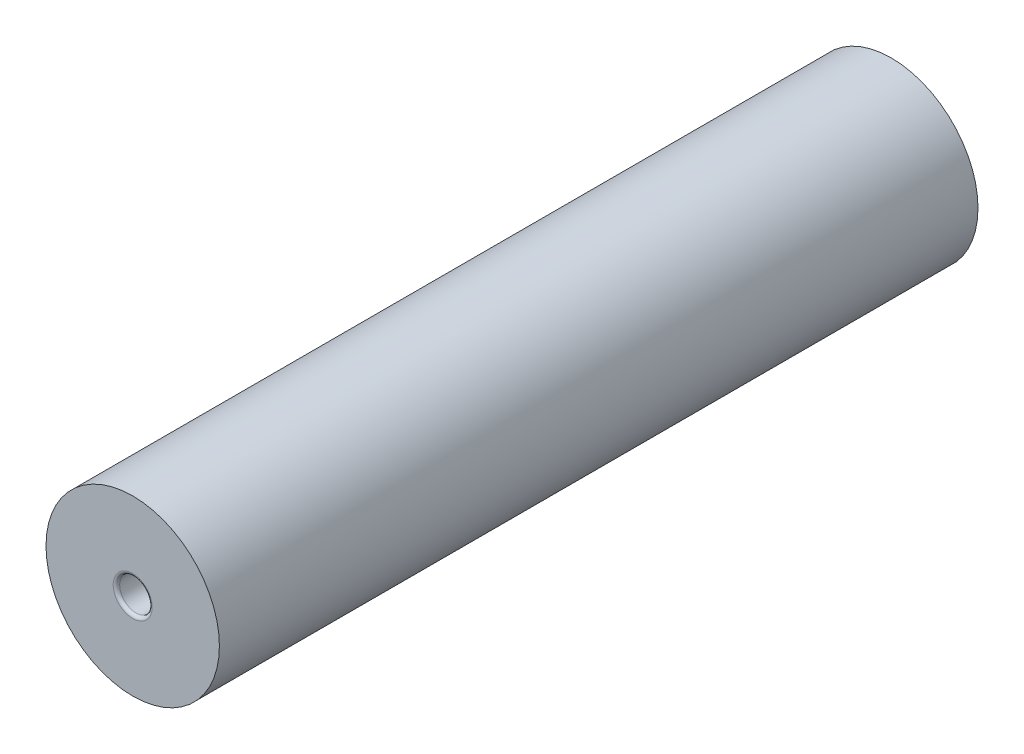
ISO-10303-21;
HEADER;
FILE_DESCRIPTION(('STEP AP214'),'2;1');
FILE_NAME('part.step','',(''),(''),'','','');
FILE_SCHEMA(('AUTOMOTIVE_DESIGN { 1 0 10303 214 1 1 1 1 }'));
ENDSEC;
DATA;
#1=APPLICATION_CONTEXT('core data for automotive mechanical design processes');
#2=APPLICATION_PROTOCOL_DEFINITION('international standard','automotive_design',2000,#1);
#3=PRODUCT_CONTEXT('',#1,'mechanical');
#4=PRODUCT('Part','Part','',(#3));
#5=PRODUCT_RELATED_PRODUCT_CATEGORY('part','',(#4));
#6=PRODUCT_DEFINITION_FORMATION('','',#4);
#7=PRODUCT_DEFINITION_CONTEXT('part definition',#1,'design');
#8=PRODUCT_DEFINITION('design','',#6,#7);
#9=PRODUCT_DEFINITION_SHAPE('','',#8);
#10=(LENGTH_UNIT() NAMED_UNIT(*) SI_UNIT(.MILLI.,.METRE.));
#11=(NAMED_UNIT(*) PLANE_ANGLE_UNIT() SI_UNIT($,.RADIAN.));
#12=(NAMED_UNIT(*) SI_UNIT($,.STERADIAN.) SOLID_ANGLE_UNIT());
#13=UNCERTAINTY_MEASURE_WITH_UNIT(LENGTH_MEASURE(1.E-05),#10,'distance_accuracy_value','');
#14=(GEOMETRIC_REPRESENTATION_CONTEXT(3) GLOBAL_UNCERTAINTY_ASSIGNED_CONTEXT((#13)) GLOBAL_UNIT_ASSIGNED_CONTEXT((#10,
#11,#12)) REPRESENTATION_CONTEXT('',''));
#15=CARTESIAN_POINT('',(0.,0.,0.));
#16=DIRECTION('',(0.,0.,1.));
#17=DIRECTION('',(1.,0.,0.));
#18=AXIS2_PLACEMENT_3D('',#15,#16,#17);
#19=CARTESIAN_POINT('',(0.,0.,-70.));
#20=DIRECTION('',(0.,0.,1.));
#21=DIRECTION('',(1.,0.,0.));
#22=AXIS2_PLACEMENT_3D('',#19,#20,#21);
#23=CYLINDRICAL_SURFACE('',#22,8.);
#24=CARTESIAN_POINT('',(0.,0.,-70.));
#25=DIRECTION('',(0.,0.,1.));
#26=DIRECTION('',(1.,0.,0.));
#27=AXIS2_PLACEMENT_3D('',#24,#25,#26);
#28=CIRCLE('',#27,8.);
#29=CARTESIAN_POINT('',(8.,0.,-70.));
#30=VERTEX_POINT('',#29);
#31=EDGE_CURVE('E57',#30,#30,#28,.T.);
#32=ORIENTED_EDGE('',*,*,#31,.T.);
#33=EDGE_LOOP('',(#32));
#34=FACE_BOUND('',#33,.T.);
#35=CARTESIAN_POINT('',(0.,0.,0.));
#36=DIRECTION('',(0.,0.,1.));
#37=DIRECTION('',(1.,0.,0.));
#38=AXIS2_PLACEMENT_3D('',#35,#36,#37);
#39=CIRCLE('',#38,8.);
#40=CARTESIAN_POINT('',(8.,0.,0.));
#41=VERTEX_POINT('',#40);
#42=EDGE_CURVE('E58',#41,#41,#39,.T.);
#43=ORIENTED_EDGE('',*,*,#42,.F.);
#44=EDGE_LOOP('',(#43));
#45=FACE_BOUND('',#44,.T.);
#46=ADVANCED_FACE('F37',(#34,#45),#23,.T.);
#47=CARTESIAN_POINT('',(0.,0.,-70.));
#48=DIRECTION('',(0.,0.,1.));
#49=DIRECTION('',(1.,0.,0.));
#50=AXIS2_PLACEMENT_3D('',#47,#48,#49);
#51=PLANE('',#50);
#52=CARTESIAN_POINT('',(0.,0.,-70.));
#53=DIRECTION('',(0.,0.,1.));
#54=DIRECTION('',(1.,0.,0.));
#55=AXIS2_PLACEMENT_3D('',#52,#53,#54);
#56=CIRCLE('',#55,1.8);
#57=CARTESIAN_POINT('',(1.8,0.,-70.));
#58=VERTEX_POINT('',#57);
#59=EDGE_CURVE('E52',#58,#58,#56,.T.);
#60=ORIENTED_EDGE('',*,*,#59,.T.);
#61=EDGE_LOOP('',(#60));
#62=FACE_BOUND('',#61,.T.);
#63=ORIENTED_EDGE('',*,*,#31,.F.);
#64=EDGE_LOOP('',(#63));
#65=FACE_BOUND('',#64,.T.);
#66=ADVANCED_FACE('F66',(#62,#65),#51,.F.);
#67=CARTESIAN_POINT('',(0.,0.,0.));
#68=DIRECTION('',(0.,0.,1.));
#69=DIRECTION('',(1.,0.,0.));
#70=AXIS2_PLACEMENT_3D('',#67,#68,#69);
#71=PLANE('',#70);
#72=CARTESIAN_POINT('',(0.,0.,0.));
#73=DIRECTION('',(0.,0.,1.));
#74=DIRECTION('',(1.,0.,0.));
#75=AXIS2_PLACEMENT_3D('',#72,#73,#74);
#76=CIRCLE('',#75,1.8);
#77=CARTESIAN_POINT('',(1.8,0.,0.));
#78=VERTEX_POINT('',#77);
#79=EDGE_CURVE('E10',#78,#78,#76,.F.);
#80=ORIENTED_EDGE('',*,*,#79,.T.);
#81=EDGE_LOOP('',(#80));
#82=FACE_BOUND('',#81,.T.);
#83=ORIENTED_EDGE('',*,*,#42,.T.);
#84=EDGE_LOOP('',(#83));
#85=FACE_BOUND('',#84,.T.);
#86=ADVANCED_FACE('F68',(#82,#85),#71,.T.);
#87=CARTESIAN_POINT('',(0.,0.,-70.));
#88=DIRECTION('',(0.,0.,1.));
#89=DIRECTION('',(1.,0.,0.));
#90=AXIS2_PLACEMENT_3D('',#87,#88,#89);
#91=CYLINDRICAL_SURFACE('',#90,1.5);
#92=CARTESIAN_POINT('',(0.,0.,-69.7));
#93=DIRECTION('',(0.,0.,1.));
#94=DIRECTION('',(1.,0.,0.));
#95=AXIS2_PLACEMENT_3D('',#92,#93,#94);
#96=CIRCLE('',#95,1.5);
#97=CARTESIAN_POINT('',(1.5,0.,-69.7));
#98=VERTEX_POINT('',#97);
#99=EDGE_CURVE('E44',#98,#98,#96,.F.);
#100=ORIENTED_EDGE('',*,*,#99,.T.);
#101=EDGE_LOOP('',(#100));
#102=FACE_BOUND('',#101,.T.);
#103=CARTESIAN_POINT('',(0.,0.,-0.299999999999995));
#104=DIRECTION('',(0.,0.,1.));
#105=DIRECTION('',(1.,0.,0.));
#106=AXIS2_PLACEMENT_3D('',#103,#104,#105);
#107=CIRCLE('',#106,1.5);
#108=CARTESIAN_POINT('',(1.5,0.,-0.299999999999995));
#109=VERTEX_POINT('',#108);
#110=EDGE_CURVE('E48',#109,#109,#107,.T.);
#111=ORIENTED_EDGE('',*,*,#110,.T.);
#112=EDGE_LOOP('',(#111));
#113=FACE_BOUND('',#112,.T.);
#114=ADVANCED_FACE('F75',(#102,#113),#91,.F.);
#115=CARTESIAN_POINT('',(0.,0.,-69.7));
#116=DIRECTION('',(0.,0.,1.));
#117=DIRECTION('',(1.,0.,0.));
#118=AXIS2_PLACEMENT_3D('',#115,#116,#117);
#119=TOROIDAL_SURFACE('',#118,1.8,0.3);
#120=ORIENTED_EDGE('',*,*,#99,.F.);
#121=EDGE_LOOP('',(#120));
#122=FACE_BOUND('',#121,.T.);
#123=ORIENTED_EDGE('',*,*,#59,.F.);
#124=EDGE_LOOP('',(#123));
#125=FACE_BOUND('',#124,.T.);
#126=ADVANCED_FACE('F79',(#122,#125),#119,.T.);
#127=CARTESIAN_POINT('',(0.,0.,-0.299999999999995));
#128=DIRECTION('',(0.,0.,1.));
#129=DIRECTION('',(1.,0.,0.));
#130=AXIS2_PLACEMENT_3D('',#127,#128,#129);
#131=TOROIDAL_SURFACE('',#130,1.8,0.3);
#132=ORIENTED_EDGE('',*,*,#79,.F.);
#133=EDGE_LOOP('',(#132));
#134=FACE_BOUND('',#133,.T.);
#135=ORIENTED_EDGE('',*,*,#110,.F.);
#136=EDGE_LOOP('',(#135));
#137=FACE_BOUND('',#136,.T.);
#138=ADVANCED_FACE('F39',(#134,#137),#131,.T.);
#139=CLOSED_SHELL('',(#46,#66,#86,#114,#126,#138));
#140=MANIFOLD_SOLID_BREP('B2',#139);
#141=ADVANCED_BREP_SHAPE_REPRESENTATION('',(#18,#140),#14);
#142=SHAPE_DEFINITION_REPRESENTATION(#9,#141);
ENDSEC;
END-ISO-10303-21;
